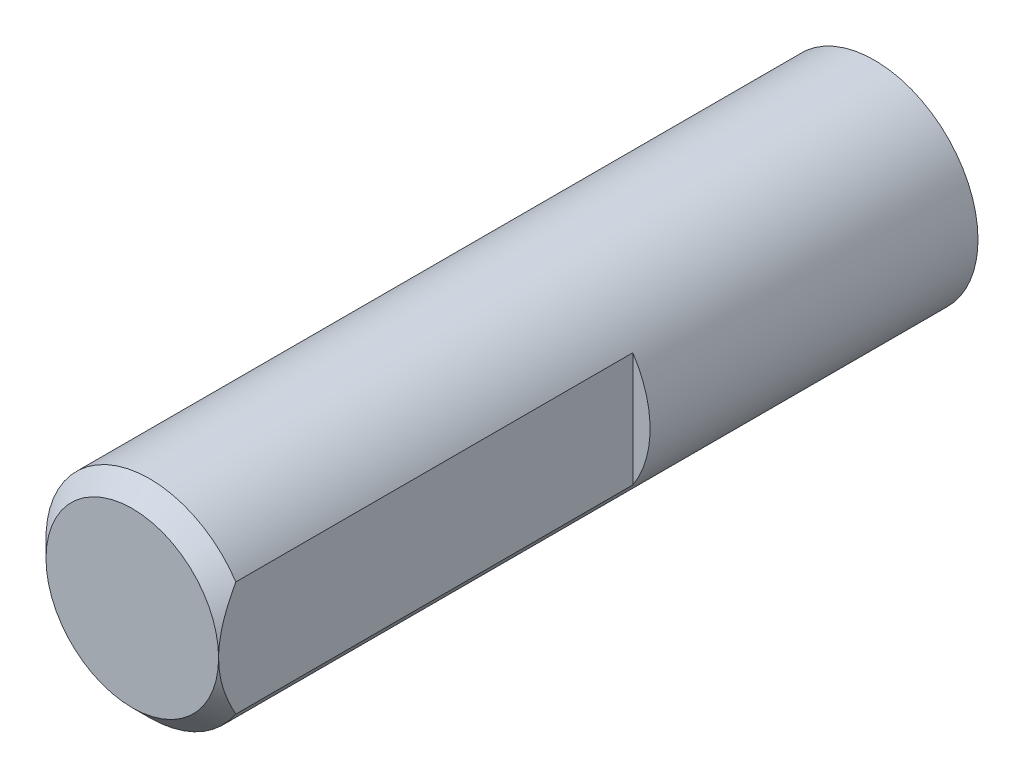
ISO-10303-21;
HEADER;
FILE_DESCRIPTION(('STEP AP214'),'2;1');
FILE_NAME('part.step','',(''),(''),'','','');
FILE_SCHEMA(('AUTOMOTIVE_DESIGN { 1 0 10303 214 1 1 1 1 }'));
ENDSEC;
DATA;
#1=APPLICATION_CONTEXT('core data for automotive mechanical design processes');
#2=APPLICATION_PROTOCOL_DEFINITION('international standard','automotive_design',2000,#1);
#3=PRODUCT_CONTEXT('',#1,'mechanical');
#4=PRODUCT('Part','Part','',(#3));
#5=PRODUCT_RELATED_PRODUCT_CATEGORY('part','',(#4));
#6=PRODUCT_DEFINITION_FORMATION('','',#4);
#7=PRODUCT_DEFINITION_CONTEXT('part definition',#1,'design');
#8=PRODUCT_DEFINITION('design','',#6,#7);
#9=PRODUCT_DEFINITION_SHAPE('','',#8);
#10=(LENGTH_UNIT() NAMED_UNIT(*) SI_UNIT(.MILLI.,.METRE.));
#11=(NAMED_UNIT(*) PLANE_ANGLE_UNIT() SI_UNIT($,.RADIAN.));
#12=(NAMED_UNIT(*) SI_UNIT($,.STERADIAN.) SOLID_ANGLE_UNIT());
#13=UNCERTAINTY_MEASURE_WITH_UNIT(LENGTH_MEASURE(1.E-05),#10,'distance_accuracy_value','');
#14=(GEOMETRIC_REPRESENTATION_CONTEXT(3) GLOBAL_UNCERTAINTY_ASSIGNED_CONTEXT((#13)) GLOBAL_UNIT_ASSIGNED_CONTEXT((#10,
#11,#12)) REPRESENTATION_CONTEXT('',''));
#15=CARTESIAN_POINT('',(0.,0.,0.));
#16=DIRECTION('',(0.,0.,1.));
#17=DIRECTION('',(1.,0.,0.));
#18=AXIS2_PLACEMENT_3D('',#15,#16,#17);
#19=CARTESIAN_POINT('',(0.,0.,21.5));
#20=DIRECTION('',(0.,0.,-1.));
#21=DIRECTION('',(-1.,0.,0.));
#22=AXIS2_PLACEMENT_3D('',#19,#20,#21);
#23=CYLINDRICAL_SURFACE('',#22,3.);
#24=DIRECTION('',(0.,0.,1.));
#25=VECTOR('',#24,1.);
#26=CARTESIAN_POINT('',(2.5,-1.6583123951777,9.5));
#27=LINE('',#26,#25);
#28=CARTESIAN_POINT('',(2.5,-1.6583123951777,9.5));
#29=VERTEX_POINT('',#28);
#30=CARTESIAN_POINT('',(2.5,-1.6583123951777,21.));
#31=VERTEX_POINT('',#30);
#32=EDGE_CURVE('E82',#29,#31,#27,.T.);
#33=ORIENTED_EDGE('',*,*,#32,.T.);
#34=CARTESIAN_POINT('',(0.,0.,21.));
#35=DIRECTION('',(0.,0.,1.));
#36=DIRECTION('',(1.,0.,0.));
#37=AXIS2_PLACEMENT_3D('',#34,#35,#36);
#38=CIRCLE('',#37,3.);
#39=CARTESIAN_POINT('',(2.5,1.6583123951777,21.));
#40=VERTEX_POINT('',#39);
#41=EDGE_CURVE('E11',#31,#40,#38,.F.);
#42=ORIENTED_EDGE('',*,*,#41,.T.);
#43=DIRECTION('',(0.,0.,1.));
#44=VECTOR('',#43,1.);
#45=CARTESIAN_POINT('',(2.5,1.6583123951777,9.5));
#46=LINE('',#45,#44);
#47=CARTESIAN_POINT('',(2.5,1.6583123951777,9.5));
#48=VERTEX_POINT('',#47);
#49=EDGE_CURVE('E80',#48,#40,#46,.T.);
#50=ORIENTED_EDGE('',*,*,#49,.F.);
#51=CARTESIAN_POINT('',(0.,0.,9.5));
#52=DIRECTION('',(0.,0.,1.));
#53=DIRECTION('',(1.,0.,0.));
#54=AXIS2_PLACEMENT_3D('',#51,#52,#53);
#55=CIRCLE('',#54,3.);
#56=EDGE_CURVE('E73',#29,#48,#55,.T.);
#57=ORIENTED_EDGE('',*,*,#56,.F.);
#58=EDGE_LOOP('',(#33,#42,#50,#57));
#59=FACE_BOUND('',#58,.T.);
#60=CARTESIAN_POINT('',(0.,0.,0.));
#61=DIRECTION('',(0.,0.,1.));
#62=DIRECTION('',(1.,0.,0.));
#63=AXIS2_PLACEMENT_3D('',#60,#61,#62);
#64=CIRCLE('',#63,3.);
#65=CARTESIAN_POINT('',(3.,0.,0.));
#66=VERTEX_POINT('',#65);
#67=EDGE_CURVE('E91',#66,#66,#64,.T.);
#68=ORIENTED_EDGE('',*,*,#67,.T.);
#69=EDGE_LOOP('',(#68));
#70=FACE_BOUND('',#69,.T.);
#71=ADVANCED_FACE('F41',(#59,#70),#23,.T.);
#72=CARTESIAN_POINT('',(0.,0.,21.5));
#73=DIRECTION('',(0.,0.,1.));
#74=DIRECTION('',(1.,0.,0.));
#75=AXIS2_PLACEMENT_3D('',#72,#73,#74);
#76=PLANE('',#75);
#77=CARTESIAN_POINT('',(0.,0.,21.5));
#78=DIRECTION('',(0.,0.,1.));
#79=DIRECTION('',(1.,0.,0.));
#80=AXIS2_PLACEMENT_3D('',#77,#78,#79);
#81=CIRCLE('',#80,2.5);
#82=CARTESIAN_POINT('',(2.5,0.,21.5));
#83=VERTEX_POINT('',#82);
#84=EDGE_CURVE('E97',#83,#83,#81,.T.);
#85=ORIENTED_EDGE('',*,*,#84,.T.);
#86=EDGE_LOOP('',(#85));
#87=FACE_BOUND('',#86,.T.);
#88=ADVANCED_FACE('F116',(#87),#76,.T.);
#89=CARTESIAN_POINT('',(0.,0.,0.));
#90=DIRECTION('',(0.,0.,1.));
#91=DIRECTION('',(1.,0.,0.));
#92=AXIS2_PLACEMENT_3D('',#89,#90,#91);
#93=PLANE('',#92);
#94=ORIENTED_EDGE('',*,*,#67,.F.);
#95=EDGE_LOOP('',(#94));
#96=FACE_BOUND('',#95,.T.);
#97=ADVANCED_FACE('F115',(#96),#93,.F.);
#98=CARTESIAN_POINT('',(2.5,1.6583123951777,9.5));
#99=DIRECTION('',(-1.,0.,0.));
#100=DIRECTION('',(0.,0.,1.));
#101=AXIS2_PLACEMENT_3D('',#98,#99,#100);
#102=PLANE('',#101);
#103=CARTESIAN_POINT('',(2.5,1.6583123951777,21.));
#104=CARTESIAN_POINT('',(2.5,1.61304419071273,21.0250200255843));
#105=CARTESIAN_POINT('',(2.5,1.56747781751027,21.049499427219));
#106=CARTESIAN_POINT('',(2.5,1.47571363154993,21.0972096867305));
#107=CARTESIAN_POINT('',(2.5,1.42951600534284,21.1204409038781));
#108=CARTESIAN_POINT('',(2.5,1.28946898250347,21.188233741468));
#109=CARTESIAN_POINT('',(2.5,1.19456817295725,21.2306685534991));
#110=CARTESIAN_POINT('',(2.5,1.00435832661106,21.3071641313579));
#111=CARTESIAN_POINT('',(2.5,0.909128166857117,21.3414185932365));
#112=CARTESIAN_POINT('',(2.5,0.715960996402805,21.4011186383457));
#113=CARTESIAN_POINT('',(2.5,0.618025975916641,21.4265705213043));
#114=CARTESIAN_POINT('',(2.5,0.434096531038006,21.46395141614));
#115=CARTESIAN_POINT('',(2.5,0.348395131920399,21.4772928993308));
#116=CARTESIAN_POINT('',(2.5,0.218706232970867,21.4908266543301));
#117=CARTESIAN_POINT('',(2.5,0.17504227488708,21.4942588205655));
#118=CARTESIAN_POINT('',(2.5,0.0875881850216984,21.4988484547413));
#119=CARTESIAN_POINT('',(2.5,0.0437980337548221,21.5000055502065));
#120=CARTESIAN_POINT('',(2.5,0.,21.5));
#121=B_SPLINE_CURVE_WITH_KNOTS('',3,(#103,#104,#105,#106,#107,#108,#109,#110,#111,#112,#113,
#114,#115,#116,#117,#118,#119,#120),.UNSPECIFIED.,.F.,.F.,(4,2,2,2,2,2,2,2,4),(0.,
0.155160114661541,0.310275326953931,0.621889187467566,0.925164565305232,1.22822244720193,
1.48798349653102,1.61932602447731,1.75069005406606),.UNSPECIFIED.);
#122=EDGE_CURVE('E100',#40,#83,#121,.T.);
#123=ORIENTED_EDGE('',*,*,#122,.T.);
#124=CARTESIAN_POINT('',(2.5,0.,21.5));
#125=CARTESIAN_POINT('',(2.5,-0.0768428391803911,21.5000643176381));
#126=CARTESIAN_POINT('',(2.5,-0.153646619440305,21.4964585669139));
#127=CARTESIAN_POINT('',(2.5,-0.306486913990631,21.4824138186156));
#128=CARTESIAN_POINT('',(2.5,-0.382524604614592,21.4719877566791));
#129=CARTESIAN_POINT('',(2.5,-0.532231201598341,21.4450231886171));
#130=CARTESIAN_POINT('',(2.5,-0.605918543015125,21.4285851348585));
#131=CARTESIAN_POINT('',(2.5,-0.751897163106768,21.3903277696489));
#132=CARTESIAN_POINT('',(2.5,-0.824187885624651,21.3685063602176));
#133=CARTESIAN_POINT('',(2.5,-0.961361204559369,21.3222417065684));
#134=CARTESIAN_POINT('',(2.5,-1.02636662586387,21.2981581621012));
#135=CARTESIAN_POINT('',(2.5,-1.15505562355539,21.2466971992364));
#136=CARTESIAN_POINT('',(2.5,-1.21873914323977,21.2193196398836));
#137=CARTESIAN_POINT('',(2.5,-1.34581351001767,21.1613450460911));
#138=CARTESIAN_POINT('',(2.5,-1.40918435962136,21.1307045192353));
#139=CARTESIAN_POINT('',(2.5,-1.53466113602633,21.067035036112));
#140=CARTESIAN_POINT('',(2.5,-1.59676793059763,21.0340077944289));
#141=CARTESIAN_POINT('',(2.5,-1.6583123951777,21.));
#142=B_SPLINE_CURVE_WITH_KNOTS('',3,(#124,#125,#126,#127,#128,#129,#130,#131,#132,#133,#134,
#135,#136,#137,#138,#139,#140,#141),.UNSPECIFIED.,.F.,.F.,(4,2,2,2,2,2,2,2,4),(0.,
0.230381722715165,0.460327757459297,0.686595219702824,0.912951001700758,1.120819357645,
1.32869661170077,1.53981070703045,1.75077462023261),.UNSPECIFIED.);
#143=EDGE_CURVE('E51',#83,#31,#142,.T.);
#144=ORIENTED_EDGE('',*,*,#143,.T.);
#145=ORIENTED_EDGE('',*,*,#32,.F.);
#146=DIRECTION('',(0.,-1.,0.));
#147=VECTOR('',#146,1.);
#148=CARTESIAN_POINT('',(2.5,1.6583123951777,9.5));
#149=LINE('',#148,#147);
#150=EDGE_CURVE('E76',#48,#29,#149,.T.);
#151=ORIENTED_EDGE('',*,*,#150,.F.);
#152=ORIENTED_EDGE('',*,*,#49,.T.);
#153=EDGE_LOOP('',(#123,#144,#145,#151,#152));
#154=FACE_BOUND('',#153,.T.);
#155=ADVANCED_FACE('F79',(#154),#102,.F.);
#156=CARTESIAN_POINT('',(0.,0.,9.5));
#157=DIRECTION('',(0.,0.,1.));
#158=DIRECTION('',(1.,0.,0.));
#159=AXIS2_PLACEMENT_3D('',#156,#157,#158);
#160=PLANE('',#159);
#161=ORIENTED_EDGE('',*,*,#56,.T.);
#162=ORIENTED_EDGE('',*,*,#150,.T.);
#163=EDGE_LOOP('',(#161,#162));
#164=FACE_BOUND('',#163,.T.);
#165=ADVANCED_FACE('F75',(#164),#160,.T.);
#166=CARTESIAN_POINT('',(0.,0.,21.5));
#167=DIRECTION('',(0.,0.,-1.));
#168=DIRECTION('',(-1.,0.,0.));
#169=AXIS2_PLACEMENT_3D('',#166,#167,#168);
#170=CONICAL_SURFACE('',#169,2.5,0.78539816339745);
#171=ORIENTED_EDGE('',*,*,#122,.F.);
#172=ORIENTED_EDGE('',*,*,#41,.F.);
#173=ORIENTED_EDGE('',*,*,#143,.F.);
#174=ORIENTED_EDGE('',*,*,#84,.F.);
#175=EDGE_LOOP('',(#171,#172,#173,#174));
#176=FACE_BOUND('',#175,.T.);
#177=ADVANCED_FACE('F43',(#176),#170,.T.);
#178=CLOSED_SHELL('',(#71,#88,#97,#155,#165,#177));
#179=MANIFOLD_SOLID_BREP('B2',#178);
#180=ADVANCED_BREP_SHAPE_REPRESENTATION('',(#18,#179),#14);
#181=SHAPE_DEFINITION_REPRESENTATION(#9,#180);
ENDSEC;
END-ISO-10303-21;
